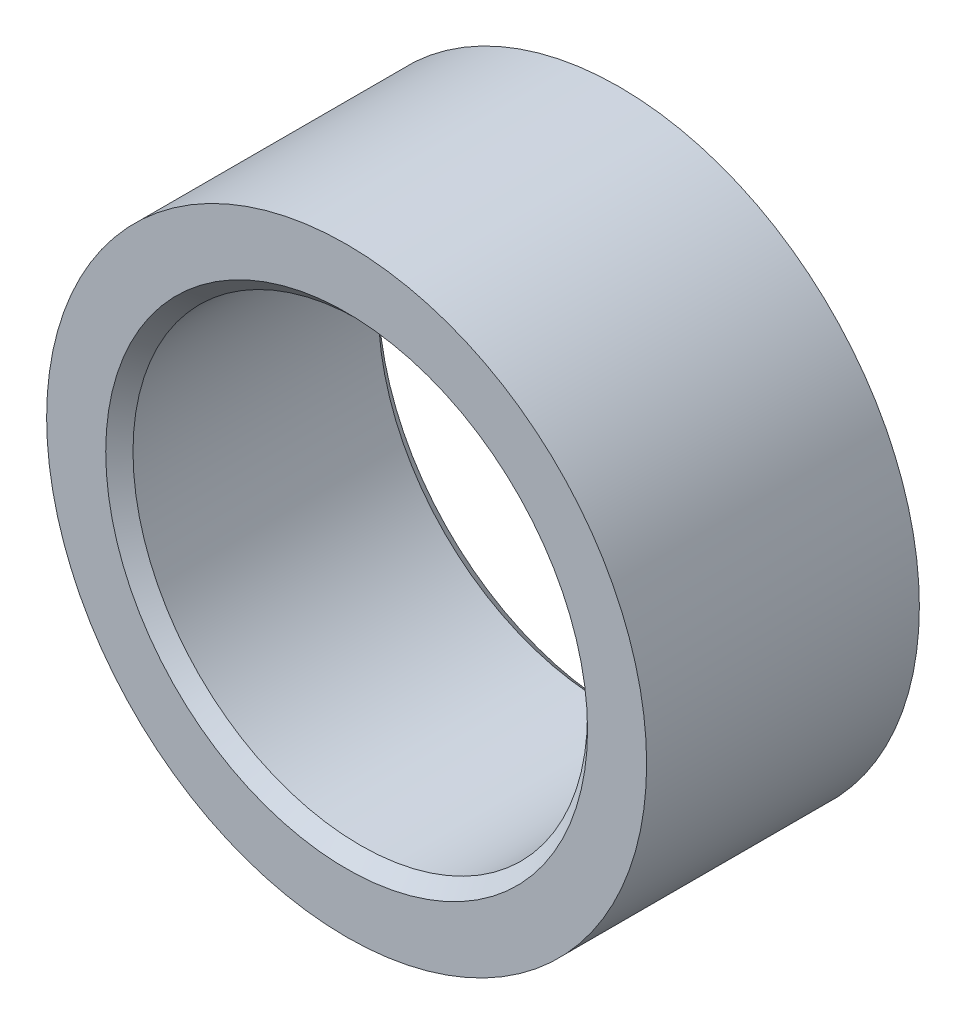
ISO-10303-21;
HEADER;
FILE_DESCRIPTION(('STEP AP214'),'2;1');
FILE_NAME('part.step','',(''),(''),'','','');
FILE_SCHEMA(('AUTOMOTIVE_DESIGN { 1 0 10303 214 1 1 1 1 }'));
ENDSEC;
DATA;
#1=APPLICATION_CONTEXT('core data for automotive mechanical design processes');
#2=APPLICATION_PROTOCOL_DEFINITION('international standard','automotive_design',2000,#1);
#3=PRODUCT_CONTEXT('',#1,'mechanical');
#4=PRODUCT('Part','Part','',(#3));
#5=PRODUCT_RELATED_PRODUCT_CATEGORY('part','',(#4));
#6=PRODUCT_DEFINITION_FORMATION('','',#4);
#7=PRODUCT_DEFINITION_CONTEXT('part definition',#1,'design');
#8=PRODUCT_DEFINITION('design','',#6,#7);
#9=PRODUCT_DEFINITION_SHAPE('','',#8);
#10=(LENGTH_UNIT() NAMED_UNIT(*) SI_UNIT(.MILLI.,.METRE.));
#11=(NAMED_UNIT(*) PLANE_ANGLE_UNIT() SI_UNIT($,.RADIAN.));
#12=(NAMED_UNIT(*) SI_UNIT($,.STERADIAN.) SOLID_ANGLE_UNIT());
#13=UNCERTAINTY_MEASURE_WITH_UNIT(LENGTH_MEASURE(1.E-05),#10,'distance_accuracy_value','');
#14=(GEOMETRIC_REPRESENTATION_CONTEXT(3) GLOBAL_UNCERTAINTY_ASSIGNED_CONTEXT((#13)) GLOBAL_UNIT_ASSIGNED_CONTEXT((#10,
#11,#12)) REPRESENTATION_CONTEXT('',''));
#15=CARTESIAN_POINT('',(0.,0.,0.));
#16=DIRECTION('',(0.,0.,1.));
#17=DIRECTION('',(1.,0.,0.));
#18=AXIS2_PLACEMENT_3D('',#15,#16,#17);
#19=CARTESIAN_POINT('',(0.,0.,3.));
#20=DIRECTION('',(0.,0.,1.));
#21=DIRECTION('',(1.,0.,0.));
#22=AXIS2_PLACEMENT_3D('',#19,#20,#21);
#23=PLANE('',#22);
#24=CARTESIAN_POINT('',(0.,0.,3.));
#25=DIRECTION('',(0.,0.,1.));
#26=DIRECTION('',(1.,0.,0.));
#27=AXIS2_PLACEMENT_3D('',#24,#25,#26);
#28=CIRCLE('',#27,5.3);
#29=CARTESIAN_POINT('',(5.3,0.,3.));
#30=VERTEX_POINT('',#29);
#31=EDGE_CURVE('E10',#30,#30,#28,.F.);
#32=ORIENTED_EDGE('',*,*,#31,.T.);
#33=EDGE_LOOP('',(#32));
#34=FACE_BOUND('',#33,.T.);
#35=CARTESIAN_POINT('',(0.,0.,3.));
#36=DIRECTION('',(0.,0.,1.));
#37=DIRECTION('',(1.,0.,0.));
#38=AXIS2_PLACEMENT_3D('',#35,#36,#37);
#39=CIRCLE('',#38,6.6);
#40=CARTESIAN_POINT('',(6.6,0.,3.));
#41=VERTEX_POINT('',#40);
#42=EDGE_CURVE('E51',#41,#41,#39,.T.);
#43=ORIENTED_EDGE('',*,*,#42,.T.);
#44=EDGE_LOOP('',(#43));
#45=FACE_BOUND('',#44,.T.);
#46=ADVANCED_FACE('F31',(#34,#45),#23,.T.);
#47=CARTESIAN_POINT('',(0.,0.,-3.));
#48=DIRECTION('',(0.,0.,1.));
#49=DIRECTION('',(1.,0.,0.));
#50=AXIS2_PLACEMENT_3D('',#47,#48,#49);
#51=PLANE('',#50);
#52=CARTESIAN_POINT('',(0.,0.,-3.));
#53=DIRECTION('',(0.,0.,1.));
#54=DIRECTION('',(1.,0.,0.));
#55=AXIS2_PLACEMENT_3D('',#52,#53,#54);
#56=CIRCLE('',#55,5.3);
#57=CARTESIAN_POINT('',(5.3,0.,-3.));
#58=VERTEX_POINT('',#57);
#59=EDGE_CURVE('E46',#58,#58,#56,.T.);
#60=ORIENTED_EDGE('',*,*,#59,.T.);
#61=EDGE_LOOP('',(#60));
#62=FACE_BOUND('',#61,.T.);
#63=CARTESIAN_POINT('',(0.,0.,-3.));
#64=DIRECTION('',(0.,0.,1.));
#65=DIRECTION('',(1.,0.,0.));
#66=AXIS2_PLACEMENT_3D('',#63,#64,#65);
#67=CIRCLE('',#66,6.6);
#68=CARTESIAN_POINT('',(6.6,0.,-3.));
#69=VERTEX_POINT('',#68);
#70=EDGE_CURVE('E52',#69,#69,#67,.T.);
#71=ORIENTED_EDGE('',*,*,#70,.F.);
#72=EDGE_LOOP('',(#71));
#73=FACE_BOUND('',#72,.T.);
#74=ADVANCED_FACE('F63',(#62,#73),#51,.F.);
#75=CARTESIAN_POINT('',(0.,0.,3.));
#76=DIRECTION('',(0.,0.,-1.));
#77=DIRECTION('',(-1.,0.,0.));
#78=AXIS2_PLACEMENT_3D('',#75,#76,#77);
#79=CYLINDRICAL_SURFACE('',#78,6.6);
#80=ORIENTED_EDGE('',*,*,#42,.F.);
#81=EDGE_LOOP('',(#80));
#82=FACE_BOUND('',#81,.T.);
#83=ORIENTED_EDGE('',*,*,#70,.T.);
#84=EDGE_LOOP('',(#83));
#85=FACE_BOUND('',#84,.T.);
#86=ADVANCED_FACE('F59',(#82,#85),#79,.T.);
#87=CARTESIAN_POINT('',(0.,0.,3.));
#88=DIRECTION('',(0.,0.,-1.));
#89=DIRECTION('',(-1.,0.,0.));
#90=AXIS2_PLACEMENT_3D('',#87,#88,#89);
#91=CYLINDRICAL_SURFACE('',#90,5.);
#92=CARTESIAN_POINT('',(0.,0.,-2.7));
#93=DIRECTION('',(0.,0.,1.));
#94=DIRECTION('',(1.,0.,0.));
#95=AXIS2_PLACEMENT_3D('',#92,#93,#94);
#96=CIRCLE('',#95,5.);
#97=CARTESIAN_POINT('',(5.,0.,-2.7));
#98=VERTEX_POINT('',#97);
#99=EDGE_CURVE('E38',#98,#98,#96,.F.);
#100=ORIENTED_EDGE('',*,*,#99,.T.);
#101=EDGE_LOOP('',(#100));
#102=FACE_BOUND('',#101,.T.);
#103=CARTESIAN_POINT('',(0.,0.,2.7));
#104=DIRECTION('',(0.,0.,1.));
#105=DIRECTION('',(1.,0.,0.));
#106=AXIS2_PLACEMENT_3D('',#103,#104,#105);
#107=CIRCLE('',#106,5.);
#108=CARTESIAN_POINT('',(5.,0.,2.7));
#109=VERTEX_POINT('',#108);
#110=EDGE_CURVE('E42',#109,#109,#107,.T.);
#111=ORIENTED_EDGE('',*,*,#110,.T.);
#112=EDGE_LOOP('',(#111));
#113=FACE_BOUND('',#112,.T.);
#114=ADVANCED_FACE('F62',(#102,#113),#91,.F.);
#115=CARTESIAN_POINT('',(0.,0.,-3.));
#116=DIRECTION('',(0.,0.,-1.));
#117=DIRECTION('',(-1.,0.,0.));
#118=AXIS2_PLACEMENT_3D('',#115,#116,#117);
#119=CONICAL_SURFACE('',#118,5.3,0.785398163397448);
#120=ORIENTED_EDGE('',*,*,#99,.F.);
#121=EDGE_LOOP('',(#120));
#122=FACE_BOUND('',#121,.T.);
#123=ORIENTED_EDGE('',*,*,#59,.F.);
#124=EDGE_LOOP('',(#123));
#125=FACE_BOUND('',#124,.T.);
#126=ADVANCED_FACE('F75',(#122,#125),#119,.F.);
#127=CARTESIAN_POINT('',(0.,0.,2.7));
#128=DIRECTION('',(0.,0.,1.));
#129=DIRECTION('',(1.,0.,0.));
#130=AXIS2_PLACEMENT_3D('',#127,#128,#129);
#131=CONICAL_SURFACE('',#130,5.,0.785398163397457);
#132=ORIENTED_EDGE('',*,*,#31,.F.);
#133=EDGE_LOOP('',(#132));
#134=FACE_BOUND('',#133,.T.);
#135=ORIENTED_EDGE('',*,*,#110,.F.);
#136=EDGE_LOOP('',(#135));
#137=FACE_BOUND('',#136,.T.);
#138=ADVANCED_FACE('F33',(#134,#137),#131,.F.);
#139=CLOSED_SHELL('',(#46,#74,#86,#114,#126,#138));
#140=MANIFOLD_SOLID_BREP('B2',#139);
#141=ADVANCED_BREP_SHAPE_REPRESENTATION('',(#18,#140),#14);
#142=SHAPE_DEFINITION_REPRESENTATION(#9,#141);
ENDSEC;
END-ISO-10303-21;
